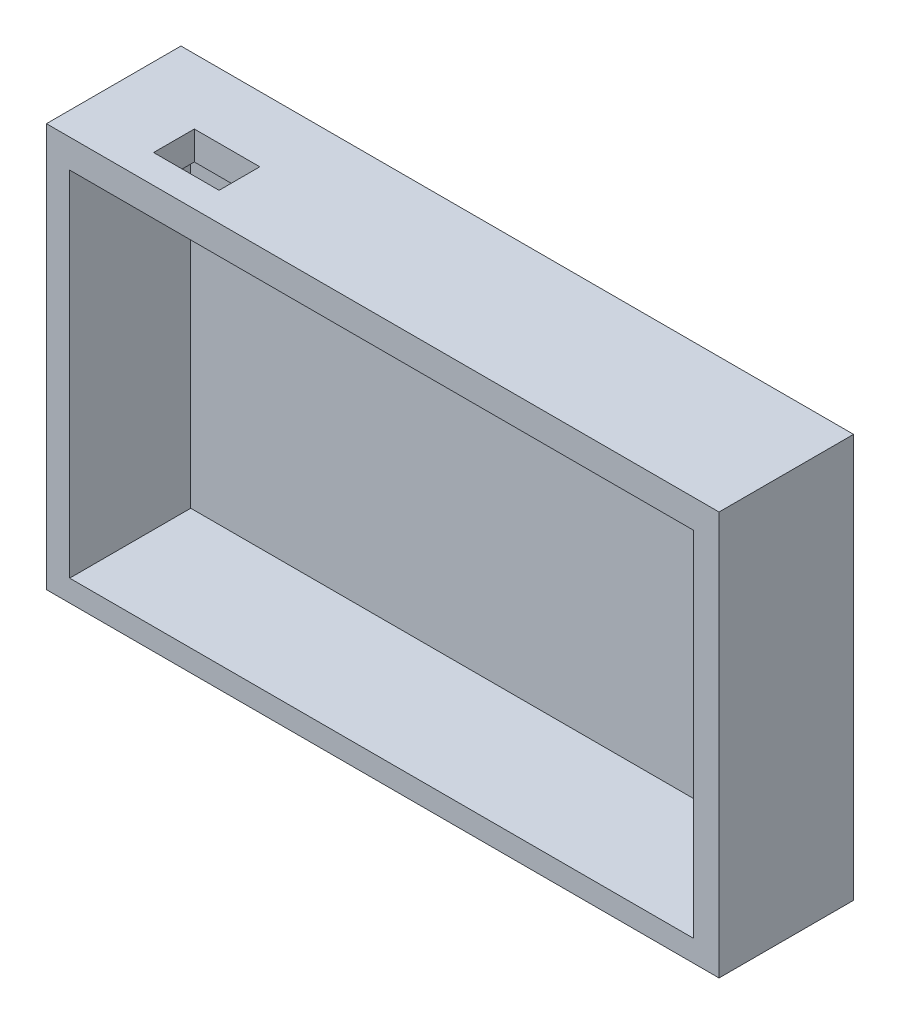
ISO-10303-21;
HEADER;
FILE_DESCRIPTION(('STEP AP214'),'2;1');
FILE_NAME('part.step','',(''),(''),'','','');
FILE_SCHEMA(('AUTOMOTIVE_DESIGN { 1 0 10303 214 1 1 1 1 }'));
ENDSEC;
DATA;
#1=APPLICATION_CONTEXT('core data for automotive mechanical design processes');
#2=APPLICATION_PROTOCOL_DEFINITION('international standard','automotive_design',2000,#1);
#3=PRODUCT_CONTEXT('',#1,'mechanical');
#4=PRODUCT('Part','Part','',(#3));
#5=PRODUCT_RELATED_PRODUCT_CATEGORY('part','',(#4));
#6=PRODUCT_DEFINITION_FORMATION('','',#4);
#7=PRODUCT_DEFINITION_CONTEXT('part definition',#1,'design');
#8=PRODUCT_DEFINITION('design','',#6,#7);
#9=PRODUCT_DEFINITION_SHAPE('','',#8);
#10=(LENGTH_UNIT() NAMED_UNIT(*) SI_UNIT(.MILLI.,.METRE.));
#11=(NAMED_UNIT(*) PLANE_ANGLE_UNIT() SI_UNIT($,.RADIAN.));
#12=(NAMED_UNIT(*) SI_UNIT($,.STERADIAN.) SOLID_ANGLE_UNIT());
#13=UNCERTAINTY_MEASURE_WITH_UNIT(LENGTH_MEASURE(1.E-05),#10,'distance_accuracy_value','');
#14=(GEOMETRIC_REPRESENTATION_CONTEXT(3) GLOBAL_UNCERTAINTY_ASSIGNED_CONTEXT((#13)) GLOBAL_UNIT_ASSIGNED_CONTEXT((#10,
#11,#12)) REPRESENTATION_CONTEXT('',''));
#15=CARTESIAN_POINT('',(0.,0.,0.));
#16=DIRECTION('',(0.,0.,1.));
#17=DIRECTION('',(1.,0.,0.));
#18=AXIS2_PLACEMENT_3D('',#15,#16,#17);
#19=CARTESIAN_POINT('',(-44.2105263157895,23.1578947368421,20.));
#20=DIRECTION('',(1.,0.,0.));
#21=DIRECTION('',(0.,0.,-1.));
#22=AXIS2_PLACEMENT_3D('',#19,#20,#21);
#23=PLANE('',#22);
#24=DIRECTION('',(0.,-1.,0.));
#25=VECTOR('',#24,1.);
#26=CARTESIAN_POINT('',(-44.2105263157895,23.1578947368421,0.));
#27=LINE('',#26,#25);
#28=CARTESIAN_POINT('',(-44.2105263157895,23.1578947368421,0.));
#29=VERTEX_POINT('',#28);
#30=CARTESIAN_POINT('',(-44.2105263157895,-36.8421052631579,0.));
#31=VERTEX_POINT('',#30);
#32=EDGE_CURVE('E186',#29,#31,#27,.T.);
#33=ORIENTED_EDGE('',*,*,#32,.T.);
#34=DIRECTION('',(0.,0.,-1.));
#35=VECTOR('',#34,1.);
#36=CARTESIAN_POINT('',(-44.2105263157895,-36.8421052631579,20.));
#37=LINE('',#36,#35);
#38=CARTESIAN_POINT('',(-44.2105263157895,-36.8421052631579,20.));
#39=VERTEX_POINT('',#38);
#40=EDGE_CURVE('E219',#39,#31,#37,.T.);
#41=ORIENTED_EDGE('',*,*,#40,.F.);
#42=DIRECTION('',(0.,-1.,0.));
#43=VECTOR('',#42,1.);
#44=CARTESIAN_POINT('',(-44.2105263157895,23.1578947368421,20.));
#45=LINE('',#44,#43);
#46=CARTESIAN_POINT('',(-44.2105263157895,23.1578947368421,20.));
#47=VERTEX_POINT('',#46);
#48=EDGE_CURVE('E193',#47,#39,#45,.T.);
#49=ORIENTED_EDGE('',*,*,#48,.F.);
#50=DIRECTION('',(0.,0.,-1.));
#51=VECTOR('',#50,1.);
#52=CARTESIAN_POINT('',(-44.2105263157895,23.1578947368421,20.));
#53=LINE('',#52,#51);
#54=EDGE_CURVE('E203',#47,#29,#53,.T.);
#55=ORIENTED_EDGE('',*,*,#54,.T.);
#56=EDGE_LOOP('',(#33,#41,#49,#55));
#57=FACE_BOUND('',#56,.T.);
#58=ADVANCED_FACE('F44',(#57),#23,.F.);
#59=CARTESIAN_POINT('',(-44.2105263157895,-36.8421052631579,20.));
#60=DIRECTION('',(0.,1.,0.));
#61=DIRECTION('',(0.,0.,1.));
#62=AXIS2_PLACEMENT_3D('',#59,#60,#61);
#63=PLANE('',#62);
#64=DIRECTION('',(1.,0.,0.));
#65=VECTOR('',#64,1.);
#66=CARTESIAN_POINT('',(-44.2105263157895,-36.8421052631579,0.));
#67=LINE('',#66,#65);
#68=CARTESIAN_POINT('',(55.7894736842105,-36.8421052631579,0.));
#69=VERTEX_POINT('',#68);
#70=EDGE_CURVE('E206',#31,#69,#67,.T.);
#71=ORIENTED_EDGE('',*,*,#70,.T.);
#72=DIRECTION('',(0.,0.,-1.));
#73=VECTOR('',#72,1.);
#74=CARTESIAN_POINT('',(55.7894736842105,-36.8421052631579,20.));
#75=LINE('',#74,#73);
#76=CARTESIAN_POINT('',(55.7894736842105,-36.8421052631579,20.));
#77=VERTEX_POINT('',#76);
#78=EDGE_CURVE('E216',#77,#69,#75,.T.);
#79=ORIENTED_EDGE('',*,*,#78,.F.);
#80=DIRECTION('',(1.,0.,0.));
#81=VECTOR('',#80,1.);
#82=CARTESIAN_POINT('',(-44.2105263157895,-36.8421052631579,20.));
#83=LINE('',#82,#81);
#84=EDGE_CURVE('E196',#39,#77,#83,.T.);
#85=ORIENTED_EDGE('',*,*,#84,.F.);
#86=ORIENTED_EDGE('',*,*,#40,.T.);
#87=EDGE_LOOP('',(#71,#79,#85,#86));
#88=FACE_BOUND('',#87,.T.);
#89=ADVANCED_FACE('F245',(#88),#63,.F.);
#90=CARTESIAN_POINT('',(55.7894736842105,23.1578947368421,20.));
#91=DIRECTION('',(-1.,0.,0.));
#92=DIRECTION('',(0.,-1.,0.));
#93=AXIS2_PLACEMENT_3D('',#90,#91,#92);
#94=PLANE('',#93);
#95=DIRECTION('',(0.,1.,0.));
#96=VECTOR('',#95,1.);
#97=CARTESIAN_POINT('',(55.7894736842105,23.1578947368421,0.));
#98=LINE('',#97,#96);
#99=CARTESIAN_POINT('',(55.7894736842105,23.1578947368421,0.));
#100=VERTEX_POINT('',#99);
#101=EDGE_CURVE('E208',#69,#100,#98,.T.);
#102=ORIENTED_EDGE('',*,*,#101,.T.);
#103=DIRECTION('',(0.,0.,-1.));
#104=VECTOR('',#103,1.);
#105=CARTESIAN_POINT('',(55.7894736842105,23.1578947368421,20.));
#106=LINE('',#105,#104);
#107=CARTESIAN_POINT('',(55.7894736842105,23.1578947368421,20.));
#108=VERTEX_POINT('',#107);
#109=EDGE_CURVE('E213',#108,#100,#106,.T.);
#110=ORIENTED_EDGE('',*,*,#109,.F.);
#111=DIRECTION('',(0.,1.,0.));
#112=VECTOR('',#111,1.);
#113=CARTESIAN_POINT('',(55.7894736842105,23.1578947368421,20.));
#114=LINE('',#113,#112);
#115=EDGE_CURVE('E199',#77,#108,#114,.T.);
#116=ORIENTED_EDGE('',*,*,#115,.F.);
#117=ORIENTED_EDGE('',*,*,#78,.T.);
#118=EDGE_LOOP('',(#102,#110,#116,#117));
#119=FACE_BOUND('',#118,.T.);
#120=ADVANCED_FACE('F250',(#119),#94,.F.);
#121=CARTESIAN_POINT('',(-44.2105263157895,23.1578947368421,20.));
#122=DIRECTION('',(0.,-1.,0.));
#123=DIRECTION('',(0.,0.,-1.));
#124=AXIS2_PLACEMENT_3D('',#121,#122,#123);
#125=PLANE('',#124);
#126=DIRECTION('',(-1.,0.,0.));
#127=VECTOR('',#126,1.);
#128=CARTESIAN_POINT('',(-22.7949294116172,23.1578947368421,9.69087178734185));
#129=LINE('',#128,#127);
#130=CARTESIAN_POINT('',(-22.7949294116172,23.1578947368421,9.69087178734185));
#131=VERTEX_POINT('',#130);
#132=CARTESIAN_POINT('',(-32.5300994396898,23.1578947368421,9.69087178734185));
#133=VERTEX_POINT('',#132);
#134=EDGE_CURVE('E144',#131,#133,#129,.T.);
#135=ORIENTED_EDGE('',*,*,#134,.F.);
#136=DIRECTION('',(0.,0.,-1.));
#137=VECTOR('',#136,1.);
#138=CARTESIAN_POINT('',(-22.7949294116172,23.1578947368421,15.7491779798562));
#139=LINE('',#138,#137);
#140=CARTESIAN_POINT('',(-22.7949294116172,23.1578947368421,15.7491779798562));
#141=VERTEX_POINT('',#140);
#142=EDGE_CURVE('E58',#141,#131,#139,.T.);
#143=ORIENTED_EDGE('',*,*,#142,.F.);
#144=DIRECTION('',(1.,0.,0.));
#145=VECTOR('',#144,1.);
#146=CARTESIAN_POINT('',(-32.5300994396898,23.1578947368421,15.7491779798562));
#147=LINE('',#146,#145);
#148=CARTESIAN_POINT('',(-32.5300994396898,23.1578947368421,15.7491779798562));
#149=VERTEX_POINT('',#148);
#150=EDGE_CURVE('E151',#149,#141,#147,.T.);
#151=ORIENTED_EDGE('',*,*,#150,.F.);
#152=DIRECTION('',(0.,0.,1.));
#153=VECTOR('',#152,1.);
#154=CARTESIAN_POINT('',(-32.5300994396898,23.1578947368421,9.69087178734185));
#155=LINE('',#154,#153);
#156=EDGE_CURVE('E135',#133,#149,#155,.T.);
#157=ORIENTED_EDGE('',*,*,#156,.F.);
#158=EDGE_LOOP('',(#135,#143,#151,#157));
#159=FACE_BOUND('',#158,.T.);
#160=DIRECTION('',(-1.,0.,0.));
#161=VECTOR('',#160,1.);
#162=CARTESIAN_POINT('',(-44.2105263157895,23.1578947368421,0.));
#163=LINE('',#162,#161);
#164=EDGE_CURVE('E197',#100,#29,#163,.T.);
#165=ORIENTED_EDGE('',*,*,#164,.T.);
#166=ORIENTED_EDGE('',*,*,#54,.F.);
#167=DIRECTION('',(-1.,0.,0.));
#168=VECTOR('',#167,1.);
#169=CARTESIAN_POINT('',(-44.2105263157895,23.1578947368421,20.));
#170=LINE('',#169,#168);
#171=EDGE_CURVE('E201',#108,#47,#170,.T.);
#172=ORIENTED_EDGE('',*,*,#171,.F.);
#173=ORIENTED_EDGE('',*,*,#109,.T.);
#174=EDGE_LOOP('',(#165,#166,#172,#173));
#175=FACE_BOUND('',#174,.T.);
#176=ADVANCED_FACE('F148',(#159,#175),#125,.F.);
#177=CARTESIAN_POINT('',(0.,0.,20.));
#178=DIRECTION('',(0.,0.,1.));
#179=DIRECTION('',(1.,0.,0.));
#180=AXIS2_PLACEMENT_3D('',#177,#178,#179);
#181=PLANE('',#180);
#182=DIRECTION('',(0.,-1.,0.));
#183=VECTOR('',#182,1.);
#184=CARTESIAN_POINT('',(-40.7552799520128,18.9126584155524,20.));
#185=LINE('',#184,#183);
#186=CARTESIAN_POINT('',(-40.7552799520128,18.9126584155524,20.));
#187=VERTEX_POINT('',#186);
#188=CARTESIAN_POINT('',(-40.7552799520128,-33.6311968004508,20.));
#189=VERTEX_POINT('',#188);
#190=EDGE_CURVE('E158',#187,#189,#185,.T.);
#191=ORIENTED_EDGE('',*,*,#190,.F.);
#192=DIRECTION('',(-1.,0.,0.));
#193=VECTOR('',#192,1.);
#194=CARTESIAN_POINT('',(-40.7552799520128,18.9126584155524,20.));
#195=LINE('',#194,#193);
#196=CARTESIAN_POINT('',(52.023928962859,18.9126584155524,20.));
#197=VERTEX_POINT('',#196);
#198=EDGE_CURVE('E165',#197,#187,#195,.T.);
#199=ORIENTED_EDGE('',*,*,#198,.F.);
#200=DIRECTION('',(0.,1.,0.));
#201=VECTOR('',#200,1.);
#202=CARTESIAN_POINT('',(52.023928962859,18.9126584155524,20.));
#203=LINE('',#202,#201);
#204=CARTESIAN_POINT('',(52.023928962859,-33.6311968004508,20.));
#205=VERTEX_POINT('',#204);
#206=EDGE_CURVE('E179',#205,#197,#203,.T.);
#207=ORIENTED_EDGE('',*,*,#206,.F.);
#208=DIRECTION('',(1.,0.,0.));
#209=VECTOR('',#208,1.);
#210=CARTESIAN_POINT('',(-40.7552799520128,-33.6311968004508,20.));
#211=LINE('',#210,#209);
#212=EDGE_CURVE('E176',#189,#205,#211,.T.);
#213=ORIENTED_EDGE('',*,*,#212,.F.);
#214=EDGE_LOOP('',(#191,#199,#207,#213));
#215=FACE_BOUND('',#214,.T.);
#216=ORIENTED_EDGE('',*,*,#48,.T.);
#217=ORIENTED_EDGE('',*,*,#84,.T.);
#218=ORIENTED_EDGE('',*,*,#115,.T.);
#219=ORIENTED_EDGE('',*,*,#171,.T.);
#220=EDGE_LOOP('',(#216,#217,#218,#219));
#221=FACE_BOUND('',#220,.T.);
#222=ADVANCED_FACE('F263',(#215,#221),#181,.T.);
#223=CARTESIAN_POINT('',(0.,0.,0.));
#224=DIRECTION('',(0.,0.,1.));
#225=DIRECTION('',(1.,0.,0.));
#226=AXIS2_PLACEMENT_3D('',#223,#224,#225);
#227=PLANE('',#226);
#228=ORIENTED_EDGE('',*,*,#32,.F.);
#229=ORIENTED_EDGE('',*,*,#164,.F.);
#230=ORIENTED_EDGE('',*,*,#101,.F.);
#231=ORIENTED_EDGE('',*,*,#70,.F.);
#232=EDGE_LOOP('',(#228,#229,#230,#231));
#233=FACE_BOUND('',#232,.T.);
#234=ADVANCED_FACE('F258',(#233),#227,.F.);
#235=CARTESIAN_POINT('',(-40.7552799520128,18.9126584155524,2.00000000000001));
#236=DIRECTION('',(-1.,0.,0.));
#237=DIRECTION('',(0.,0.,1.));
#238=AXIS2_PLACEMENT_3D('',#235,#236,#237);
#239=PLANE('',#238);
#240=ORIENTED_EDGE('',*,*,#190,.T.);
#241=DIRECTION('',(0.,0.,1.));
#242=VECTOR('',#241,1.);
#243=CARTESIAN_POINT('',(-40.7552799520128,-33.6311968004508,2.00000000000001));
#244=LINE('',#243,#242);
#245=CARTESIAN_POINT('',(-40.7552799520128,-33.6311968004508,2.00000000000001));
#246=VERTEX_POINT('',#245);
#247=EDGE_CURVE('E174',#246,#189,#244,.T.);
#248=ORIENTED_EDGE('',*,*,#247,.F.);
#249=DIRECTION('',(0.,-1.,0.));
#250=VECTOR('',#249,1.);
#251=CARTESIAN_POINT('',(-40.7552799520128,18.9126584155524,2.00000000000001));
#252=LINE('',#251,#250);
#253=CARTESIAN_POINT('',(-40.7552799520128,18.9126584155524,2.00000000000001));
#254=VERTEX_POINT('',#253);
#255=EDGE_CURVE('E161',#254,#246,#252,.T.);
#256=ORIENTED_EDGE('',*,*,#255,.F.);
#257=DIRECTION('',(0.,0.,1.));
#258=VECTOR('',#257,1.);
#259=CARTESIAN_POINT('',(-40.7552799520128,18.9126584155524,2.00000000000001));
#260=LINE('',#259,#258);
#261=EDGE_CURVE('E184',#254,#187,#260,.T.);
#262=ORIENTED_EDGE('',*,*,#261,.T.);
#263=EDGE_LOOP('',(#240,#248,#256,#262));
#264=FACE_BOUND('',#263,.T.);
#265=ADVANCED_FACE('F276',(#264),#239,.F.);
#266=CARTESIAN_POINT('',(-40.7552799520128,18.9126584155524,2.00000000000001));
#267=DIRECTION('',(0.,1.,0.));
#268=DIRECTION('',(0.,0.,1.));
#269=AXIS2_PLACEMENT_3D('',#266,#267,#268);
#270=PLANE('',#269);
#271=DIRECTION('',(1.,0.,0.));
#272=VECTOR('',#271,1.);
#273=CARTESIAN_POINT('',(-40.7552799520128,18.9126584155524,15.7491779798562));
#274=LINE('',#273,#272);
#275=CARTESIAN_POINT('',(-32.5300994396898,18.9126584155524,15.7491779798562));
#276=VERTEX_POINT('',#275);
#277=CARTESIAN_POINT('',(-22.7949294116172,18.9126584155524,15.7491779798562));
#278=VERTEX_POINT('',#277);
#279=EDGE_CURVE('E51',#276,#278,#274,.T.);
#280=ORIENTED_EDGE('',*,*,#279,.T.);
#281=DIRECTION('',(0.,0.,-1.));
#282=VECTOR('',#281,1.);
#283=CARTESIAN_POINT('',(-22.7949294116172,18.9126584155524,2.00000000000001));
#284=LINE('',#283,#282);
#285=CARTESIAN_POINT('',(-22.7949294116172,18.9126584155524,9.69087178734185));
#286=VERTEX_POINT('',#285);
#287=EDGE_CURVE('E11',#278,#286,#284,.T.);
#288=ORIENTED_EDGE('',*,*,#287,.T.);
#289=DIRECTION('',(-1.,0.,0.));
#290=VECTOR('',#289,1.);
#291=CARTESIAN_POINT('',(-40.7552799520128,18.9126584155524,9.69087178734185));
#292=LINE('',#291,#290);
#293=CARTESIAN_POINT('',(-32.5300994396898,18.9126584155524,9.69087178734185));
#294=VERTEX_POINT('',#293);
#295=EDGE_CURVE('E222',#286,#294,#292,.T.);
#296=ORIENTED_EDGE('',*,*,#295,.T.);
#297=DIRECTION('',(0.,0.,1.));
#298=VECTOR('',#297,1.);
#299=CARTESIAN_POINT('',(-32.5300994396898,18.9126584155524,2.00000000000001));
#300=LINE('',#299,#298);
#301=EDGE_CURVE('E138',#294,#276,#300,.T.);
#302=ORIENTED_EDGE('',*,*,#301,.T.);
#303=EDGE_LOOP('',(#280,#288,#296,#302));
#304=FACE_BOUND('',#303,.T.);
#305=ORIENTED_EDGE('',*,*,#198,.T.);
#306=ORIENTED_EDGE('',*,*,#261,.F.);
#307=DIRECTION('',(-1.,0.,0.));
#308=VECTOR('',#307,1.);
#309=CARTESIAN_POINT('',(-40.7552799520128,18.9126584155524,2.00000000000001));
#310=LINE('',#309,#308);
#311=CARTESIAN_POINT('',(52.023928962859,18.9126584155524,2.00000000000001));
#312=VERTEX_POINT('',#311);
#313=EDGE_CURVE('E171',#312,#254,#310,.T.);
#314=ORIENTED_EDGE('',*,*,#313,.F.);
#315=DIRECTION('',(0.,0.,1.));
#316=VECTOR('',#315,1.);
#317=CARTESIAN_POINT('',(52.023928962859,18.9126584155524,2.00000000000001));
#318=LINE('',#317,#316);
#319=EDGE_CURVE('E187',#312,#197,#318,.T.);
#320=ORIENTED_EDGE('',*,*,#319,.T.);
#321=EDGE_LOOP('',(#305,#306,#314,#320));
#322=FACE_BOUND('',#321,.T.);
#323=ADVANCED_FACE('F226',(#304,#322),#270,.F.);
#324=CARTESIAN_POINT('',(52.023928962859,18.9126584155524,2.00000000000001));
#325=DIRECTION('',(1.,0.,0.));
#326=DIRECTION('',(0.,0.,-1.));
#327=AXIS2_PLACEMENT_3D('',#324,#325,#326);
#328=PLANE('',#327);
#329=ORIENTED_EDGE('',*,*,#206,.T.);
#330=ORIENTED_EDGE('',*,*,#319,.F.);
#331=DIRECTION('',(0.,1.,0.));
#332=VECTOR('',#331,1.);
#333=CARTESIAN_POINT('',(52.023928962859,18.9126584155524,2.00000000000001));
#334=LINE('',#333,#332);
#335=CARTESIAN_POINT('',(52.023928962859,-33.6311968004508,2.00000000000001));
#336=VERTEX_POINT('',#335);
#337=EDGE_CURVE('E168',#336,#312,#334,.T.);
#338=ORIENTED_EDGE('',*,*,#337,.F.);
#339=DIRECTION('',(0.,0.,1.));
#340=VECTOR('',#339,1.);
#341=CARTESIAN_POINT('',(52.023928962859,-33.6311968004508,2.00000000000001));
#342=LINE('',#341,#340);
#343=EDGE_CURVE('E189',#336,#205,#342,.T.);
#344=ORIENTED_EDGE('',*,*,#343,.T.);
#345=EDGE_LOOP('',(#329,#330,#338,#344));
#346=FACE_BOUND('',#345,.T.);
#347=ADVANCED_FACE('F285',(#346),#328,.F.);
#348=CARTESIAN_POINT('',(-40.7552799520128,-33.6311968004508,2.00000000000001));
#349=DIRECTION('',(0.,-1.,0.));
#350=DIRECTION('',(0.,0.,-1.));
#351=AXIS2_PLACEMENT_3D('',#348,#349,#350);
#352=PLANE('',#351);
#353=ORIENTED_EDGE('',*,*,#212,.T.);
#354=ORIENTED_EDGE('',*,*,#343,.F.);
#355=DIRECTION('',(1.,0.,0.));
#356=VECTOR('',#355,1.);
#357=CARTESIAN_POINT('',(-40.7552799520128,-33.6311968004508,2.00000000000001));
#358=LINE('',#357,#356);
#359=EDGE_CURVE('E164',#246,#336,#358,.T.);
#360=ORIENTED_EDGE('',*,*,#359,.F.);
#361=ORIENTED_EDGE('',*,*,#247,.T.);
#362=EDGE_LOOP('',(#353,#354,#360,#361));
#363=FACE_BOUND('',#362,.T.);
#364=ADVANCED_FACE('F240',(#363),#352,.F.);
#365=CARTESIAN_POINT('',(0.,0.,2.00000000000001));
#366=DIRECTION('',(0.,0.,1.));
#367=DIRECTION('',(1.,0.,0.));
#368=AXIS2_PLACEMENT_3D('',#365,#366,#367);
#369=PLANE('',#368);
#370=ORIENTED_EDGE('',*,*,#255,.T.);
#371=ORIENTED_EDGE('',*,*,#359,.T.);
#372=ORIENTED_EDGE('',*,*,#337,.T.);
#373=ORIENTED_EDGE('',*,*,#313,.T.);
#374=EDGE_LOOP('',(#370,#371,#372,#373));
#375=FACE_BOUND('',#374,.T.);
#376=ADVANCED_FACE('F233',(#375),#369,.T.);
#377=CARTESIAN_POINT('',(-22.7949294116172,13.1578947368421,15.7491779798562));
#378=DIRECTION('',(1.,0.,0.));
#379=DIRECTION('',(0.,0.,-1.));
#380=AXIS2_PLACEMENT_3D('',#377,#378,#379);
#381=PLANE('',#380);
#382=DIRECTION('',(0.,1.,0.));
#383=VECTOR('',#382,1.);
#384=CARTESIAN_POINT('',(-22.7949294116172,13.1578947368421,15.7491779798562));
#385=LINE('',#384,#383);
#386=EDGE_CURVE('E156',#278,#141,#385,.T.);
#387=ORIENTED_EDGE('',*,*,#386,.T.);
#388=ORIENTED_EDGE('',*,*,#142,.T.);
#389=DIRECTION('',(0.,1.,0.));
#390=VECTOR('',#389,1.);
#391=CARTESIAN_POINT('',(-22.7949294116172,13.1578947368421,9.69087178734185));
#392=LINE('',#391,#390);
#393=EDGE_CURVE('E141',#286,#131,#392,.T.);
#394=ORIENTED_EDGE('',*,*,#393,.F.);
#395=ORIENTED_EDGE('',*,*,#287,.F.);
#396=EDGE_LOOP('',(#387,#388,#394,#395));
#397=FACE_BOUND('',#396,.T.);
#398=ADVANCED_FACE('F231',(#397),#381,.F.);
#399=CARTESIAN_POINT('',(-32.5300994396898,13.1578947368421,15.7491779798562));
#400=DIRECTION('',(0.,0.,1.));
#401=DIRECTION('',(1.,0.,0.));
#402=AXIS2_PLACEMENT_3D('',#399,#400,#401);
#403=PLANE('',#402);
#404=DIRECTION('',(0.,1.,0.));
#405=VECTOR('',#404,1.);
#406=CARTESIAN_POINT('',(-32.5300994396898,13.1578947368421,15.7491779798562));
#407=LINE('',#406,#405);
#408=EDGE_CURVE('E140',#276,#149,#407,.T.);
#409=ORIENTED_EDGE('',*,*,#408,.T.);
#410=ORIENTED_EDGE('',*,*,#150,.T.);
#411=ORIENTED_EDGE('',*,*,#386,.F.);
#412=ORIENTED_EDGE('',*,*,#279,.F.);
#413=EDGE_LOOP('',(#409,#410,#411,#412));
#414=FACE_BOUND('',#413,.T.);
#415=ADVANCED_FACE('F230',(#414),#403,.F.);
#416=CARTESIAN_POINT('',(-32.5300994396898,13.1578947368421,9.69087178734185));
#417=DIRECTION('',(-1.,0.,0.));
#418=DIRECTION('',(0.,0.,1.));
#419=AXIS2_PLACEMENT_3D('',#416,#417,#418);
#420=PLANE('',#419);
#421=DIRECTION('',(0.,1.,0.));
#422=VECTOR('',#421,1.);
#423=CARTESIAN_POINT('',(-32.5300994396898,13.1578947368421,9.69087178734185));
#424=LINE('',#423,#422);
#425=EDGE_CURVE('E66',#294,#133,#424,.T.);
#426=ORIENTED_EDGE('',*,*,#425,.T.);
#427=ORIENTED_EDGE('',*,*,#156,.T.);
#428=ORIENTED_EDGE('',*,*,#408,.F.);
#429=ORIENTED_EDGE('',*,*,#301,.F.);
#430=EDGE_LOOP('',(#426,#427,#428,#429));
#431=FACE_BOUND('',#430,.T.);
#432=ADVANCED_FACE('F132',(#431),#420,.F.);
#433=CARTESIAN_POINT('',(-22.7949294116172,13.1578947368421,9.69087178734185));
#434=DIRECTION('',(0.,0.,-1.));
#435=DIRECTION('',(-1.,0.,0.));
#436=AXIS2_PLACEMENT_3D('',#433,#434,#435);
#437=PLANE('',#436);
#438=ORIENTED_EDGE('',*,*,#393,.T.);
#439=ORIENTED_EDGE('',*,*,#134,.T.);
#440=ORIENTED_EDGE('',*,*,#425,.F.);
#441=ORIENTED_EDGE('',*,*,#295,.F.);
#442=EDGE_LOOP('',(#438,#439,#440,#441));
#443=FACE_BOUND('',#442,.T.);
#444=ADVANCED_FACE('F145',(#443),#437,.F.);
#445=CLOSED_SHELL('',(#58,#89,#120,#176,#222,#234,#265,#323,#347,#364,#376,#398,#415,#432,#444));
#446=MANIFOLD_SOLID_BREP('B2',#445);
#447=ADVANCED_BREP_SHAPE_REPRESENTATION('',(#18,#446),#14);
#448=SHAPE_DEFINITION_REPRESENTATION(#9,#447);
ENDSEC;
END-ISO-10303-21;
